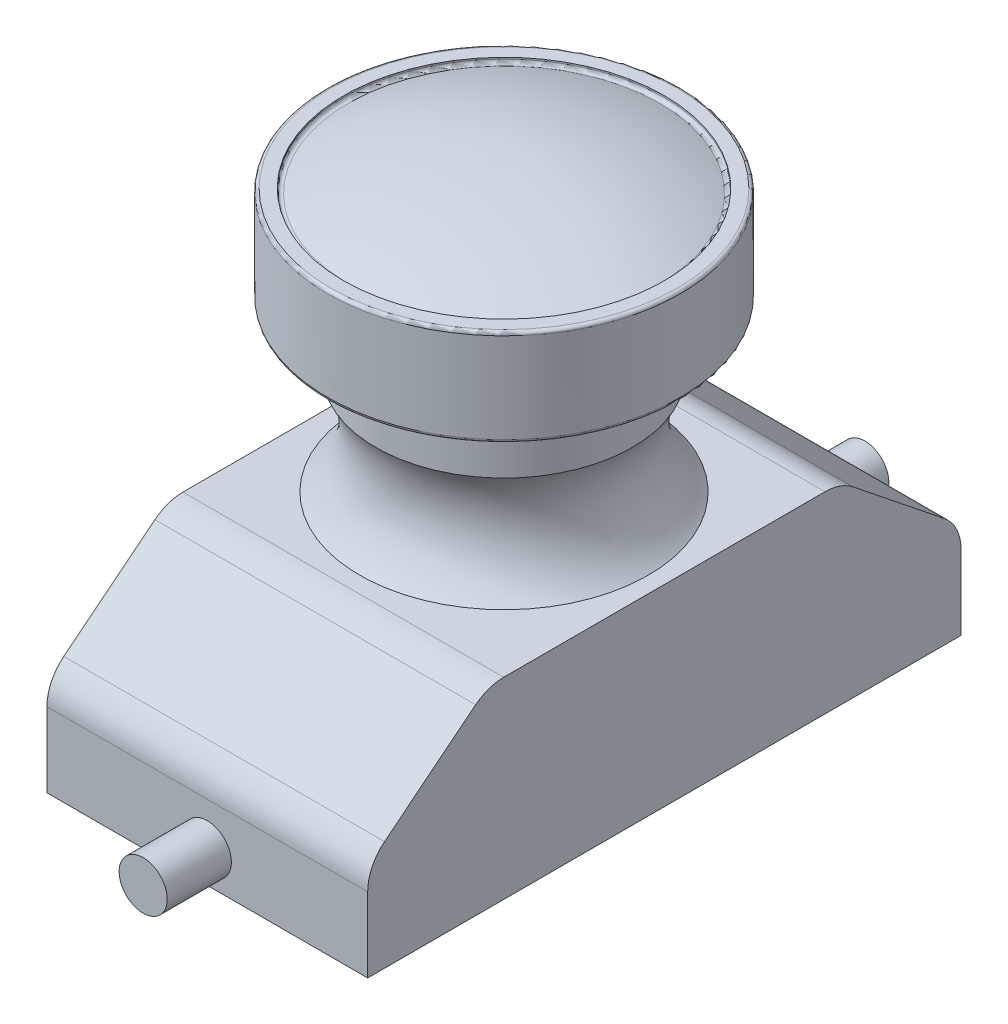
ISO-10303-21;
HEADER;
FILE_DESCRIPTION(('STEP AP214'),'2;1');
FILE_NAME('part.step','',(''),(''),'','','');
FILE_SCHEMA(('AUTOMOTIVE_DESIGN { 1 0 10303 214 1 1 1 1 }'));
ENDSEC;
DATA;
#1=APPLICATION_CONTEXT('core data for automotive mechanical design processes');
#2=APPLICATION_PROTOCOL_DEFINITION('international standard','automotive_design',2000,#1);
#3=PRODUCT_CONTEXT('',#1,'mechanical');
#4=PRODUCT('Part','Part','',(#3));
#5=PRODUCT_RELATED_PRODUCT_CATEGORY('part','',(#4));
#6=PRODUCT_DEFINITION_FORMATION('','',#4);
#7=PRODUCT_DEFINITION_CONTEXT('part definition',#1,'design');
#8=PRODUCT_DEFINITION('design','',#6,#7);
#9=PRODUCT_DEFINITION_SHAPE('','',#8);
#10=(LENGTH_UNIT() NAMED_UNIT(*) SI_UNIT(.MILLI.,.METRE.));
#11=(NAMED_UNIT(*) PLANE_ANGLE_UNIT() SI_UNIT($,.RADIAN.));
#12=(NAMED_UNIT(*) SI_UNIT($,.STERADIAN.) SOLID_ANGLE_UNIT());
#13=UNCERTAINTY_MEASURE_WITH_UNIT(LENGTH_MEASURE(1.E-05),#10,'distance_accuracy_value','');
#14=(GEOMETRIC_REPRESENTATION_CONTEXT(3) GLOBAL_UNCERTAINTY_ASSIGNED_CONTEXT((#13)) GLOBAL_UNIT_ASSIGNED_CONTEXT((#10,
#11,#12)) REPRESENTATION_CONTEXT('',''));
#15=CARTESIAN_POINT('',(0.,0.,0.));
#16=DIRECTION('',(0.,0.,1.));
#17=DIRECTION('',(1.,0.,0.));
#18=AXIS2_PLACEMENT_3D('',#15,#16,#17);
#19=CARTESIAN_POINT('',(5.,0.,9.25));
#20=DIRECTION('',(0.,0.,-1.));
#21=DIRECTION('',(-1.,0.,0.));
#22=AXIS2_PLACEMENT_3D('',#19,#20,#21);
#23=PLANE('',#22);
#24=CARTESIAN_POINT('',(0.,1.,9.25));
#25=DIRECTION('',(0.,0.,-1.));
#26=DIRECTION('',(-1.,0.,0.));
#27=AXIS2_PLACEMENT_3D('',#24,#25,#26);
#28=CIRCLE('',#27,0.75);
#29=CARTESIAN_POINT('',(-0.75,1.,9.25));
#30=VERTEX_POINT('',#29);
#31=EDGE_CURVE('E368',#30,#30,#28,.T.);
#32=ORIENTED_EDGE('',*,*,#31,.T.);
#33=EDGE_LOOP('',(#32));
#34=FACE_BOUND('',#33,.T.);
#35=DIRECTION('',(0.,-1.,0.));
#36=VECTOR('',#35,1.);
#37=CARTESIAN_POINT('',(5.,0.,9.25));
#38=LINE('',#37,#36);
#39=CARTESIAN_POINT('',(5.,2.3271252135188,9.25));
#40=VERTEX_POINT('',#39);
#41=CARTESIAN_POINT('',(5.,0.,9.25));
#42=VERTEX_POINT('',#41);
#43=EDGE_CURVE('E267',#40,#42,#38,.T.);
#44=ORIENTED_EDGE('',*,*,#43,.F.);
#45=DIRECTION('',(-1.,0.,0.));
#46=VECTOR('',#45,1.);
#47=CARTESIAN_POINT('',(5.,2.3271252135188,9.25));
#48=LINE('',#47,#46);
#49=CARTESIAN_POINT('',(-5.,2.3271252135188,9.25));
#50=VERTEX_POINT('',#49);
#51=EDGE_CURVE('E299',#40,#50,#48,.T.);
#52=ORIENTED_EDGE('',*,*,#51,.T.);
#53=DIRECTION('',(0.,-1.,0.));
#54=VECTOR('',#53,1.);
#55=CARTESIAN_POINT('',(-5.,0.,9.25));
#56=LINE('',#55,#54);
#57=CARTESIAN_POINT('',(-5.,0.,9.25));
#58=VERTEX_POINT('',#57);
#59=EDGE_CURVE('E332',#50,#58,#56,.T.);
#60=ORIENTED_EDGE('',*,*,#59,.T.);
#61=DIRECTION('',(-1.,0.,0.));
#62=VECTOR('',#61,1.);
#63=CARTESIAN_POINT('',(5.,0.,9.25));
#64=LINE('',#63,#62);
#65=EDGE_CURVE('E271',#42,#58,#64,.T.);
#66=ORIENTED_EDGE('',*,*,#65,.F.);
#67=EDGE_LOOP('',(#44,#52,#60,#66));
#68=FACE_BOUND('',#67,.T.);
#69=ADVANCED_FACE('F55',(#34,#68),#23,.F.);
#70=CARTESIAN_POINT('',(5.,0.,9.25));
#71=DIRECTION('',(0.,1.,0.));
#72=DIRECTION('',(0.,0.,1.));
#73=AXIS2_PLACEMENT_3D('',#70,#71,#72);
#74=PLANE('',#73);
#75=DIRECTION('',(0.,0.,-1.));
#76=VECTOR('',#75,1.);
#77=CARTESIAN_POINT('',(-5.,0.,9.25));
#78=LINE('',#77,#76);
#79=CARTESIAN_POINT('',(-5.,0.,-9.25));
#80=VERTEX_POINT('',#79);
#81=EDGE_CURVE('E260',#58,#80,#78,.T.);
#82=ORIENTED_EDGE('',*,*,#81,.T.);
#83=DIRECTION('',(-1.,0.,0.));
#84=VECTOR('',#83,1.);
#85=CARTESIAN_POINT('',(5.,0.,-9.25));
#86=LINE('',#85,#84);
#87=CARTESIAN_POINT('',(5.,0.,-9.25));
#88=VERTEX_POINT('',#87);
#89=EDGE_CURVE('E268',#88,#80,#86,.T.);
#90=ORIENTED_EDGE('',*,*,#89,.F.);
#91=DIRECTION('',(0.,0.,-1.));
#92=VECTOR('',#91,1.);
#93=CARTESIAN_POINT('',(5.,0.,9.25));
#94=LINE('',#93,#92);
#95=EDGE_CURVE('E235',#42,#88,#94,.T.);
#96=ORIENTED_EDGE('',*,*,#95,.F.);
#97=ORIENTED_EDGE('',*,*,#65,.T.);
#98=EDGE_LOOP('',(#82,#90,#96,#97));
#99=FACE_BOUND('',#98,.T.);
#100=ADVANCED_FACE('F155',(#99),#74,.F.);
#101=CARTESIAN_POINT('',(5.,3.,-9.25));
#102=DIRECTION('',(0.,0.,1.));
#103=DIRECTION('',(1.,0.,0.));
#104=AXIS2_PLACEMENT_3D('',#101,#102,#103);
#105=PLANE('',#104);
#106=CARTESIAN_POINT('',(0.,1.,-9.25));
#107=DIRECTION('',(0.,0.,1.));
#108=DIRECTION('',(1.,0.,0.));
#109=AXIS2_PLACEMENT_3D('',#106,#107,#108);
#110=CIRCLE('',#109,0.75);
#111=CARTESIAN_POINT('',(0.75,1.,-9.25));
#112=VERTEX_POINT('',#111);
#113=EDGE_CURVE('E11',#112,#112,#110,.F.);
#114=ORIENTED_EDGE('',*,*,#113,.F.);
#115=EDGE_LOOP('',(#114));
#116=FACE_BOUND('',#115,.T.);
#117=DIRECTION('',(0.,1.,0.));
#118=VECTOR('',#117,1.);
#119=CARTESIAN_POINT('',(-5.,3.,-9.25));
#120=LINE('',#119,#118);
#121=CARTESIAN_POINT('',(-5.,2.3271252135188,-9.25));
#122=VERTEX_POINT('',#121);
#123=EDGE_CURVE('E229',#80,#122,#120,.T.);
#124=ORIENTED_EDGE('',*,*,#123,.T.);
#125=DIRECTION('',(-1.,0.,0.));
#126=VECTOR('',#125,1.);
#127=CARTESIAN_POINT('',(5.,2.3271252135188,-9.25));
#128=LINE('',#127,#126);
#129=CARTESIAN_POINT('',(5.,2.3271252135188,-9.25));
#130=VERTEX_POINT('',#129);
#131=EDGE_CURVE('E64',#122,#130,#128,.F.);
#132=ORIENTED_EDGE('',*,*,#131,.T.);
#133=DIRECTION('',(0.,1.,0.));
#134=VECTOR('',#133,1.);
#135=CARTESIAN_POINT('',(5.,3.,-9.25));
#136=LINE('',#135,#134);
#137=EDGE_CURVE('E227',#88,#130,#136,.T.);
#138=ORIENTED_EDGE('',*,*,#137,.F.);
#139=ORIENTED_EDGE('',*,*,#89,.T.);
#140=EDGE_LOOP('',(#124,#132,#138,#139));
#141=FACE_BOUND('',#140,.T.);
#142=ADVANCED_FACE('F161',(#116,#141),#105,.F.);
#143=CARTESIAN_POINT('',(5.,6.,-5.5));
#144=DIRECTION('',(0.,-0.78086880944303,0.624695047554424));
#145=DIRECTION('',(0.,-0.624695047554424,-0.78086880944303));
#146=AXIS2_PLACEMENT_3D('',#143,#144,#145);
#147=PLANE('',#146);
#148=DIRECTION('',(0.,0.624695047554424,0.78086880944303));
#149=VECTOR('',#148,1.);
#150=CARTESIAN_POINT('',(-5.,6.,-5.5));
#151=LINE('',#150,#149);
#152=CARTESIAN_POINT('',(-5.,3.42034154673905,-8.72457306657619));
#153=VERTEX_POINT('',#152);
#154=CARTESIAN_POINT('',(-5.,5.69321633322024,-5.8834795834747));
#155=VERTEX_POINT('',#154);
#156=EDGE_CURVE('E246',#153,#155,#151,.T.);
#157=ORIENTED_EDGE('',*,*,#156,.T.);
#158=DIRECTION('',(-1.,0.,0.));
#159=VECTOR('',#158,1.);
#160=CARTESIAN_POINT('',(5.,5.69321633322024,-5.8834795834747));
#161=LINE('',#160,#159);
#162=CARTESIAN_POINT('',(5.,5.69321633322024,-5.8834795834747));
#163=VERTEX_POINT('',#162);
#164=EDGE_CURVE('E192',#155,#163,#161,.F.);
#165=ORIENTED_EDGE('',*,*,#164,.T.);
#166=DIRECTION('',(0.,0.624695047554424,0.78086880944303));
#167=VECTOR('',#166,1.);
#168=CARTESIAN_POINT('',(5.,6.,-5.5));
#169=LINE('',#168,#167);
#170=CARTESIAN_POINT('',(5.,3.42034154673905,-8.72457306657619));
#171=VERTEX_POINT('',#170);
#172=EDGE_CURVE('E238',#171,#163,#169,.T.);
#173=ORIENTED_EDGE('',*,*,#172,.F.);
#174=DIRECTION('',(-1.,0.,0.));
#175=VECTOR('',#174,1.);
#176=CARTESIAN_POINT('',(5.,3.42034154673905,-8.72457306657619));
#177=LINE('',#176,#175);
#178=EDGE_CURVE('E214',#171,#153,#177,.T.);
#179=ORIENTED_EDGE('',*,*,#178,.T.);
#180=EDGE_LOOP('',(#157,#165,#173,#179));
#181=FACE_BOUND('',#180,.T.);
#182=ADVANCED_FACE('F245',(#181),#147,.F.);
#183=CARTESIAN_POINT('',(5.,6.,5.5));
#184=DIRECTION('',(0.,-1.,0.));
#185=DIRECTION('',(0.,0.,-1.));
#186=AXIS2_PLACEMENT_3D('',#183,#184,#185);
#187=PLANE('',#186);
#188=CARTESIAN_POINT('',(0.,6.,0.));
#189=DIRECTION('',(0.,-1.,0.));
#190=DIRECTION('',(0.,0.,-1.));
#191=AXIS2_PLACEMENT_3D('',#188,#189,#190);
#192=CIRCLE('',#191,4.5);
#193=CARTESIAN_POINT('',(0.,6.,-4.5));
#194=VERTEX_POINT('',#193);
#195=EDGE_CURVE('E335',#194,#194,#192,.T.);
#196=ORIENTED_EDGE('',*,*,#195,.T.);
#197=EDGE_LOOP('',(#196));
#198=FACE_BOUND('',#197,.T.);
#199=DIRECTION('',(0.,0.,1.));
#200=VECTOR('',#199,1.);
#201=CARTESIAN_POINT('',(-5.,6.,5.5));
#202=LINE('',#201,#200);
#203=CARTESIAN_POINT('',(-5.,6.,-5.0089065168985));
#204=VERTEX_POINT('',#203);
#205=CARTESIAN_POINT('',(-5.,6.,5.0089065168985));
#206=VERTEX_POINT('',#205);
#207=EDGE_CURVE('E253',#204,#206,#202,.T.);
#208=ORIENTED_EDGE('',*,*,#207,.T.);
#209=DIRECTION('',(-1.,0.,0.));
#210=VECTOR('',#209,1.);
#211=CARTESIAN_POINT('',(5.,6.,5.0089065168985));
#212=LINE('',#211,#210);
#213=CARTESIAN_POINT('',(5.,6.,5.0089065168985));
#214=VERTEX_POINT('',#213);
#215=EDGE_CURVE('E71',#206,#214,#212,.F.);
#216=ORIENTED_EDGE('',*,*,#215,.T.);
#217=DIRECTION('',(0.,0.,1.));
#218=VECTOR('',#217,1.);
#219=CARTESIAN_POINT('',(5.,6.,5.5));
#220=LINE('',#219,#218);
#221=CARTESIAN_POINT('',(5.,6.,-5.0089065168985));
#222=VERTEX_POINT('',#221);
#223=EDGE_CURVE('E328',#222,#214,#220,.T.);
#224=ORIENTED_EDGE('',*,*,#223,.F.);
#225=DIRECTION('',(-1.,0.,0.));
#226=VECTOR('',#225,1.);
#227=CARTESIAN_POINT('',(5.,6.,-5.0089065168985));
#228=LINE('',#227,#226);
#229=EDGE_CURVE('E194',#222,#204,#228,.T.);
#230=ORIENTED_EDGE('',*,*,#229,.T.);
#231=EDGE_LOOP('',(#208,#216,#224,#230));
#232=FACE_BOUND('',#231,.T.);
#233=ADVANCED_FACE('F402',(#198,#232),#187,.F.);
#234=CARTESIAN_POINT('',(5.,3.,9.25));
#235=DIRECTION('',(0.,-0.78086880944303,-0.624695047554424));
#236=DIRECTION('',(0.,0.624695047554424,-0.78086880944303));
#237=AXIS2_PLACEMENT_3D('',#234,#235,#236);
#238=PLANE('',#237);
#239=DIRECTION('',(0.,-0.624695047554424,0.78086880944303));
#240=VECTOR('',#239,1.);
#241=CARTESIAN_POINT('',(-5.,3.,9.25));
#242=LINE('',#241,#240);
#243=CARTESIAN_POINT('',(-5.,5.69321633322024,5.8834795834747));
#244=VERTEX_POINT('',#243);
#245=CARTESIAN_POINT('',(-5.,3.42034154673905,8.72457306657619));
#246=VERTEX_POINT('',#245);
#247=EDGE_CURVE('E258',#244,#246,#242,.T.);
#248=ORIENTED_EDGE('',*,*,#247,.T.);
#249=DIRECTION('',(-1.,0.,0.));
#250=VECTOR('',#249,1.);
#251=CARTESIAN_POINT('',(5.,3.42034154673905,8.72457306657619));
#252=LINE('',#251,#250);
#253=CARTESIAN_POINT('',(5.,3.42034154673905,8.72457306657619));
#254=VERTEX_POINT('',#253);
#255=EDGE_CURVE('E204',#246,#254,#252,.F.);
#256=ORIENTED_EDGE('',*,*,#255,.T.);
#257=DIRECTION('',(0.,-0.624695047554424,0.78086880944303));
#258=VECTOR('',#257,1.);
#259=CARTESIAN_POINT('',(5.,3.,9.25));
#260=LINE('',#259,#258);
#261=CARTESIAN_POINT('',(5.,5.69321633322024,5.8834795834747));
#262=VERTEX_POINT('',#261);
#263=EDGE_CURVE('E272',#262,#254,#260,.T.);
#264=ORIENTED_EDGE('',*,*,#263,.F.);
#265=DIRECTION('',(-1.,0.,0.));
#266=VECTOR('',#265,1.);
#267=CARTESIAN_POINT('',(5.,5.69321633322024,5.8834795834747));
#268=LINE('',#267,#266);
#269=EDGE_CURVE('E313',#262,#244,#268,.T.);
#270=ORIENTED_EDGE('',*,*,#269,.T.);
#271=EDGE_LOOP('',(#248,#256,#264,#270));
#272=FACE_BOUND('',#271,.T.);
#273=ADVANCED_FACE('F321',(#272),#238,.F.);
#274=CARTESIAN_POINT('',(5.,0.,0.));
#275=DIRECTION('',(-1.,0.,0.));
#276=DIRECTION('',(0.,0.,1.));
#277=AXIS2_PLACEMENT_3D('',#274,#275,#276);
#278=PLANE('',#277);
#279=ORIENTED_EDGE('',*,*,#263,.T.);
#280=CARTESIAN_POINT('',(5.,2.3271252135188,7.85));
#281=DIRECTION('',(-1.,0.,0.));
#282=DIRECTION('',(0.,0.,1.));
#283=AXIS2_PLACEMENT_3D('',#280,#281,#282);
#284=CIRCLE('',#283,1.4);
#285=EDGE_CURVE('E202',#254,#40,#284,.F.);
#286=ORIENTED_EDGE('',*,*,#285,.T.);
#287=ORIENTED_EDGE('',*,*,#43,.T.);
#288=ORIENTED_EDGE('',*,*,#95,.T.);
#289=ORIENTED_EDGE('',*,*,#137,.T.);
#290=CARTESIAN_POINT('',(5.,2.3271252135188,-7.85));
#291=DIRECTION('',(-1.,0.,0.));
#292=DIRECTION('',(0.,0.,1.));
#293=AXIS2_PLACEMENT_3D('',#290,#291,#292);
#294=CIRCLE('',#293,1.4);
#295=EDGE_CURVE('E197',#130,#171,#294,.F.);
#296=ORIENTED_EDGE('',*,*,#295,.T.);
#297=ORIENTED_EDGE('',*,*,#172,.T.);
#298=CARTESIAN_POINT('',(5.,4.6,-5.0089065168985));
#299=DIRECTION('',(-1.,0.,0.));
#300=DIRECTION('',(0.,0.,1.));
#301=AXIS2_PLACEMENT_3D('',#298,#299,#300);
#302=CIRCLE('',#301,1.4);
#303=EDGE_CURVE('E78',#163,#222,#302,.F.);
#304=ORIENTED_EDGE('',*,*,#303,.T.);
#305=ORIENTED_EDGE('',*,*,#223,.T.);
#306=CARTESIAN_POINT('',(5.,4.6,5.0089065168985));
#307=DIRECTION('',(-1.,0.,0.));
#308=DIRECTION('',(0.,0.,1.));
#309=AXIS2_PLACEMENT_3D('',#306,#307,#308);
#310=CIRCLE('',#309,1.4);
#311=EDGE_CURVE('E196',#214,#262,#310,.F.);
#312=ORIENTED_EDGE('',*,*,#311,.T.);
#313=EDGE_LOOP('',(#279,#286,#287,#288,#289,#296,#297,#304,#305,#312));
#314=FACE_BOUND('',#313,.T.);
#315=ADVANCED_FACE('F232',(#314),#278,.F.);
#316=CARTESIAN_POINT('',(-5.,0.,0.));
#317=DIRECTION('',(-1.,0.,0.));
#318=DIRECTION('',(0.,0.,1.));
#319=AXIS2_PLACEMENT_3D('',#316,#317,#318);
#320=PLANE('',#319);
#321=ORIENTED_EDGE('',*,*,#59,.F.);
#322=CARTESIAN_POINT('',(-5.,2.3271252135188,7.85));
#323=DIRECTION('',(-1.,0.,0.));
#324=DIRECTION('',(0.,0.,1.));
#325=AXIS2_PLACEMENT_3D('',#322,#323,#324);
#326=CIRCLE('',#325,1.4);
#327=EDGE_CURVE('E310',#50,#246,#326,.T.);
#328=ORIENTED_EDGE('',*,*,#327,.T.);
#329=ORIENTED_EDGE('',*,*,#247,.F.);
#330=CARTESIAN_POINT('',(-5.,4.6,5.0089065168985));
#331=DIRECTION('',(-1.,0.,0.));
#332=DIRECTION('',(0.,0.,1.));
#333=AXIS2_PLACEMENT_3D('',#330,#331,#332);
#334=CIRCLE('',#333,1.4);
#335=EDGE_CURVE('E307',#244,#206,#334,.T.);
#336=ORIENTED_EDGE('',*,*,#335,.T.);
#337=ORIENTED_EDGE('',*,*,#207,.F.);
#338=CARTESIAN_POINT('',(-5.,4.6,-5.0089065168985));
#339=DIRECTION('',(-1.,0.,0.));
#340=DIRECTION('',(0.,0.,1.));
#341=AXIS2_PLACEMENT_3D('',#338,#339,#340);
#342=CIRCLE('',#341,1.4);
#343=EDGE_CURVE('E251',#204,#155,#342,.T.);
#344=ORIENTED_EDGE('',*,*,#343,.T.);
#345=ORIENTED_EDGE('',*,*,#156,.F.);
#346=CARTESIAN_POINT('',(-5.,2.3271252135188,-7.85));
#347=DIRECTION('',(-1.,0.,0.));
#348=DIRECTION('',(0.,0.,1.));
#349=AXIS2_PLACEMENT_3D('',#346,#347,#348);
#350=CIRCLE('',#349,1.4);
#351=EDGE_CURVE('E241',#153,#122,#350,.T.);
#352=ORIENTED_EDGE('',*,*,#351,.T.);
#353=ORIENTED_EDGE('',*,*,#123,.F.);
#354=ORIENTED_EDGE('',*,*,#81,.F.);
#355=EDGE_LOOP('',(#321,#328,#329,#336,#337,#344,#345,#352,#353,#354));
#356=FACE_BOUND('',#355,.T.);
#357=ADVANCED_FACE('F249',(#356),#320,.T.);
#358=CARTESIAN_POINT('',(0.,7.89402615915736,0.));
#359=DIRECTION('',(0.,-1.,0.));
#360=DIRECTION('',(0.,0.,-1.));
#361=AXIS2_PLACEMENT_3D('',#358,#359,#360);
#362=TOROIDAL_SURFACE('',#361,6.13176741860708,2.5);
#363=CARTESIAN_POINT('',(0.,9.20000000000001,0.));
#364=DIRECTION('',(0.,-1.,0.));
#365=DIRECTION('',(0.,0.,-1.));
#366=AXIS2_PLACEMENT_3D('',#363,#364,#365);
#367=CIRCLE('',#366,4.);
#368=CARTESIAN_POINT('',(0.,9.20000000000001,-4.));
#369=VERTEX_POINT('',#368);
#370=EDGE_CURVE('E341',#369,#369,#367,.T.);
#371=ORIENTED_EDGE('',*,*,#370,.T.);
#372=EDGE_LOOP('',(#371));
#373=FACE_BOUND('',#372,.T.);
#374=ORIENTED_EDGE('',*,*,#195,.F.);
#375=EDGE_LOOP('',(#374));
#376=FACE_BOUND('',#375,.T.);
#377=ADVANCED_FACE('F412',(#373,#376),#362,.F.);
#378=CARTESIAN_POINT('',(0.,6.,0.));
#379=DIRECTION('',(0.,-1.,0.));
#380=DIRECTION('',(0.,0.,-1.));
#381=AXIS2_PLACEMENT_3D('',#378,#379,#380);
#382=CYLINDRICAL_SURFACE('',#381,4.);
#383=CARTESIAN_POINT('',(0.,11.2,0.));
#384=DIRECTION('',(0.,-1.,0.));
#385=DIRECTION('',(0.,0.,-1.));
#386=AXIS2_PLACEMENT_3D('',#383,#384,#385);
#387=CIRCLE('',#386,4.);
#388=CARTESIAN_POINT('',(0.,11.2,-4.));
#389=VERTEX_POINT('',#388);
#390=EDGE_CURVE('E355',#389,#389,#387,.T.);
#391=ORIENTED_EDGE('',*,*,#390,.T.);
#392=EDGE_LOOP('',(#391));
#393=FACE_BOUND('',#392,.T.);
#394=ORIENTED_EDGE('',*,*,#370,.F.);
#395=EDGE_LOOP('',(#394));
#396=FACE_BOUND('',#395,.T.);
#397=ADVANCED_FACE('F417',(#393,#396),#382,.T.);
#398=CARTESIAN_POINT('',(0.,11.2,-5.5));
#399=DIRECTION('',(0.,-1.,0.));
#400=DIRECTION('',(0.,0.,-1.));
#401=AXIS2_PLACEMENT_3D('',#398,#399,#400);
#402=PLANE('',#401);
#403=CARTESIAN_POINT('',(0.,11.2,0.));
#404=DIRECTION('',(0.,-1.,0.));
#405=DIRECTION('',(0.,0.,-1.));
#406=AXIS2_PLACEMENT_3D('',#403,#404,#405);
#407=CIRCLE('',#406,5.4);
#408=CARTESIAN_POINT('',(0.,11.2,-5.4));
#409=VERTEX_POINT('',#408);
#410=EDGE_CURVE('E276',#409,#409,#407,.T.);
#411=ORIENTED_EDGE('',*,*,#410,.T.);
#412=EDGE_LOOP('',(#411));
#413=FACE_BOUND('',#412,.T.);
#414=ORIENTED_EDGE('',*,*,#390,.F.);
#415=EDGE_LOOP('',(#414));
#416=FACE_BOUND('',#415,.T.);
#417=ADVANCED_FACE('F421',(#413,#416),#402,.T.);
#418=CARTESIAN_POINT('',(0.,6.,0.));
#419=DIRECTION('',(0.,-1.,0.));
#420=DIRECTION('',(0.,0.,-1.));
#421=AXIS2_PLACEMENT_3D('',#418,#419,#420);
#422=CYLINDRICAL_SURFACE('',#421,5.5);
#423=CARTESIAN_POINT('',(0.,11.3,0.));
#424=DIRECTION('',(0.,-1.,0.));
#425=DIRECTION('',(0.,0.,-1.));
#426=AXIS2_PLACEMENT_3D('',#423,#424,#425);
#427=CIRCLE('',#426,5.5);
#428=CARTESIAN_POINT('',(0.,11.3,-5.5));
#429=VERTEX_POINT('',#428);
#430=EDGE_CURVE('E284',#429,#429,#427,.F.);
#431=ORIENTED_EDGE('',*,*,#430,.T.);
#432=EDGE_LOOP('',(#431));
#433=FACE_BOUND('',#432,.T.);
#434=CARTESIAN_POINT('',(0.,14.1,0.));
#435=DIRECTION('',(0.,1.,0.));
#436=DIRECTION('',(0.,0.,1.));
#437=AXIS2_PLACEMENT_3D('',#434,#435,#436);
#438=CIRCLE('',#437,5.5);
#439=CARTESIAN_POINT('',(0.,14.1,5.5));
#440=VERTEX_POINT('',#439);
#441=EDGE_CURVE('E280',#440,#440,#438,.F.);
#442=ORIENTED_EDGE('',*,*,#441,.T.);
#443=EDGE_LOOP('',(#442));
#444=FACE_BOUND('',#443,.T.);
#445=ADVANCED_FACE('F425',(#433,#444),#422,.T.);
#446=CARTESIAN_POINT('',(0.,14.2,-5.));
#447=DIRECTION('',(0.,1.,0.));
#448=DIRECTION('',(0.,0.,1.));
#449=AXIS2_PLACEMENT_3D('',#446,#447,#448);
#450=PLANE('',#449);
#451=CARTESIAN_POINT('',(0.,14.2,0.));
#452=DIRECTION('',(0.,1.,0.));
#453=DIRECTION('',(0.,0.,1.));
#454=AXIS2_PLACEMENT_3D('',#451,#452,#453);
#455=CIRCLE('',#454,5.4);
#456=CARTESIAN_POINT('',(0.,14.2,5.4));
#457=VERTEX_POINT('',#456);
#458=EDGE_CURVE('E288',#457,#457,#455,.T.);
#459=ORIENTED_EDGE('',*,*,#458,.T.);
#460=EDGE_LOOP('',(#459));
#461=FACE_BOUND('',#460,.T.);
#462=CARTESIAN_POINT('',(0.,14.2,0.));
#463=DIRECTION('',(0.,-1.,0.));
#464=DIRECTION('',(0.,0.,-1.));
#465=AXIS2_PLACEMENT_3D('',#462,#463,#464);
#466=CIRCLE('',#465,5.);
#467=CARTESIAN_POINT('',(0.,14.2,-5.));
#468=VERTEX_POINT('',#467);
#469=EDGE_CURVE('E359',#468,#468,#466,.T.);
#470=ORIENTED_EDGE('',*,*,#469,.T.);
#471=EDGE_LOOP('',(#470));
#472=FACE_BOUND('',#471,.T.);
#473=ADVANCED_FACE('F149',(#461,#472),#450,.T.);
#474=CARTESIAN_POINT('',(0.,6.,0.));
#475=DIRECTION('',(0.,-1.,0.));
#476=DIRECTION('',(0.,0.,-1.));
#477=AXIS2_PLACEMENT_3D('',#474,#475,#476);
#478=CYLINDRICAL_SURFACE('',#477,5.);
#479=CARTESIAN_POINT('',(0.,14.151701238125,0.));
#480=DIRECTION('',(0.,-1.,0.));
#481=DIRECTION('',(0.,0.,-1.));
#482=AXIS2_PLACEMENT_3D('',#479,#480,#481);
#483=CIRCLE('',#482,5.);
#484=CARTESIAN_POINT('',(0.,14.151701238125,-5.));
#485=VERTEX_POINT('',#484);
#486=EDGE_CURVE('E292',#485,#485,#483,.T.);
#487=ORIENTED_EDGE('',*,*,#486,.T.);
#488=EDGE_LOOP('',(#487));
#489=FACE_BOUND('',#488,.T.);
#490=ORIENTED_EDGE('',*,*,#469,.F.);
#491=EDGE_LOOP('',(#490));
#492=FACE_BOUND('',#491,.T.);
#493=ADVANCED_FACE('F139',(#489,#492),#478,.F.);
#494=CARTESIAN_POINT('',(0.,3.00167236240251,-0.200334472480498));
#495=DIRECTION('',(-1.,0.,0.));
#496=DIRECTION('',(0.,0.,-1.));
#497=AXIS2_PLACEMENT_3D('',#494,#495,#496);
#498=CIRCLE('',#497,12.);
#499=TRIMMED_CURVE('',#498,(PARAMETER_VALUE(-1.58749164174817)),
(PARAMETER_VALUE(1.58749164174817)),.T.,.PARAMETER.);
#500=CARTESIAN_POINT('',(0.,3.00167236240251,0.));
#501=DIRECTION('',(0.,-1.,0.));
#502=AXIS1_PLACEMENT('',#500,#501);
#503=SURFACE_OF_REVOLUTION('',#499,#502);
#504=CARTESIAN_POINT('',(0.,14.0595522391521,0.));
#505=DIRECTION('',(0.,-1.,0.));
#506=DIRECTION('',(0.,0.,-1.));
#507=AXIS2_PLACEMENT_3D('',#504,#505,#506);
#508=CIRCLE('',#507,4.86115978902877);
#509=CARTESIAN_POINT('',(0.,14.0595522391521,-4.86115978902877));
#510=VERTEX_POINT('',#509);
#511=EDGE_CURVE('E296',#510,#510,#508,.F.);
#512=ORIENTED_EDGE('',*,*,#511,.T.);
#513=EDGE_LOOP('',(#512));
#514=FACE_BOUND('',#513,.T.);
#515=CARTESIAN_POINT('',(0.,15.,0.));
#516=VERTEX_POINT('',#515);
#517=VERTEX_LOOP('',#516);
#518=FACE_BOUND('',#517,.T.);
#519=ADVANCED_FACE('F136',(#514,#518),#503,.T.);
#520=CARTESIAN_POINT('',(0.,11.3,0.));
#521=DIRECTION('',(0.,-1.,0.));
#522=DIRECTION('',(0.,0.,-1.));
#523=AXIS2_PLACEMENT_3D('',#520,#521,#522);
#524=TOROIDAL_SURFACE('',#523,5.4,0.1);
#525=ORIENTED_EDGE('',*,*,#430,.F.);
#526=EDGE_LOOP('',(#525));
#527=FACE_BOUND('',#526,.T.);
#528=ORIENTED_EDGE('',*,*,#410,.F.);
#529=EDGE_LOOP('',(#528));
#530=FACE_BOUND('',#529,.T.);
#531=ADVANCED_FACE('F138',(#527,#530),#524,.T.);
#532=CARTESIAN_POINT('',(0.,14.1,0.));
#533=DIRECTION('',(0.,1.,0.));
#534=DIRECTION('',(0.,0.,1.));
#535=AXIS2_PLACEMENT_3D('',#532,#533,#534);
#536=TOROIDAL_SURFACE('',#535,5.4,0.1);
#537=ORIENTED_EDGE('',*,*,#458,.F.);
#538=EDGE_LOOP('',(#537));
#539=FACE_BOUND('',#538,.T.);
#540=ORIENTED_EDGE('',*,*,#441,.F.);
#541=EDGE_LOOP('',(#540));
#542=FACE_BOUND('',#541,.T.);
#543=ADVANCED_FACE('F145',(#539,#542),#536,.T.);
#544=CARTESIAN_POINT('',(0.,14.151701238125,0.));
#545=DIRECTION('',(0.,-1.,0.));
#546=DIRECTION('',(0.,0.,-1.));
#547=AXIS2_PLACEMENT_3D('',#544,#545,#546);
#548=TOROIDAL_SURFACE('',#547,4.9,0.1);
#549=ORIENTED_EDGE('',*,*,#511,.F.);
#550=EDGE_LOOP('',(#549));
#551=FACE_BOUND('',#550,.T.);
#552=ORIENTED_EDGE('',*,*,#486,.F.);
#553=EDGE_LOOP('',(#552));
#554=FACE_BOUND('',#553,.T.);
#555=ADVANCED_FACE('F170',(#551,#554),#548,.F.);
#556=CARTESIAN_POINT('',(5.,2.3271252135188,7.85));
#557=DIRECTION('',(-1.,0.,0.));
#558=DIRECTION('',(0.,0.,1.));
#559=AXIS2_PLACEMENT_3D('',#556,#557,#558);
#560=CYLINDRICAL_SURFACE('',#559,1.4);
#561=ORIENTED_EDGE('',*,*,#285,.F.);
#562=ORIENTED_EDGE('',*,*,#255,.F.);
#563=ORIENTED_EDGE('',*,*,#327,.F.);
#564=ORIENTED_EDGE('',*,*,#51,.F.);
#565=EDGE_LOOP('',(#561,#562,#563,#564));
#566=FACE_BOUND('',#565,.T.);
#567=ADVANCED_FACE('F174',(#566),#560,.T.);
#568=CARTESIAN_POINT('',(5.,4.6,5.0089065168985));
#569=DIRECTION('',(-1.,0.,0.));
#570=DIRECTION('',(0.,0.,1.));
#571=AXIS2_PLACEMENT_3D('',#568,#569,#570);
#572=CYLINDRICAL_SURFACE('',#571,1.4);
#573=ORIENTED_EDGE('',*,*,#311,.F.);
#574=ORIENTED_EDGE('',*,*,#215,.F.);
#575=ORIENTED_EDGE('',*,*,#335,.F.);
#576=ORIENTED_EDGE('',*,*,#269,.F.);
#577=EDGE_LOOP('',(#573,#574,#575,#576));
#578=FACE_BOUND('',#577,.T.);
#579=ADVANCED_FACE('F178',(#578),#572,.T.);
#580=CARTESIAN_POINT('',(5.,4.6,-5.0089065168985));
#581=DIRECTION('',(-1.,0.,0.));
#582=DIRECTION('',(0.,0.,1.));
#583=AXIS2_PLACEMENT_3D('',#580,#581,#582);
#584=CYLINDRICAL_SURFACE('',#583,1.4);
#585=ORIENTED_EDGE('',*,*,#303,.F.);
#586=ORIENTED_EDGE('',*,*,#164,.F.);
#587=ORIENTED_EDGE('',*,*,#343,.F.);
#588=ORIENTED_EDGE('',*,*,#229,.F.);
#589=EDGE_LOOP('',(#585,#586,#587,#588));
#590=FACE_BOUND('',#589,.T.);
#591=ADVANCED_FACE('F181',(#590),#584,.T.);
#592=CARTESIAN_POINT('',(5.,2.3271252135188,-7.85));
#593=DIRECTION('',(-1.,0.,0.));
#594=DIRECTION('',(0.,0.,1.));
#595=AXIS2_PLACEMENT_3D('',#592,#593,#594);
#596=CYLINDRICAL_SURFACE('',#595,1.4);
#597=ORIENTED_EDGE('',*,*,#295,.F.);
#598=ORIENTED_EDGE('',*,*,#131,.F.);
#599=ORIENTED_EDGE('',*,*,#351,.F.);
#600=ORIENTED_EDGE('',*,*,#178,.F.);
#601=EDGE_LOOP('',(#597,#598,#599,#600));
#602=FACE_BOUND('',#601,.T.);
#603=ADVANCED_FACE('F57',(#602),#596,.T.);
#604=CARTESIAN_POINT('',(0.,1.,-11.25));
#605=DIRECTION('',(0.,0.,1.));
#606=DIRECTION('',(1.,0.,0.));
#607=AXIS2_PLACEMENT_3D('',#604,#605,#606);
#608=CYLINDRICAL_SURFACE('',#607,0.75);
#609=CARTESIAN_POINT('',(0.,1.,-11.25));
#610=DIRECTION('',(0.,0.,-1.));
#611=DIRECTION('',(-1.,0.,0.));
#612=AXIS2_PLACEMENT_3D('',#609,#610,#611);
#613=CIRCLE('',#612,0.75);
#614=CARTESIAN_POINT('',(-0.75,1.,-11.25));
#615=VERTEX_POINT('',#614);
#616=EDGE_CURVE('E363',#615,#615,#613,.T.);
#617=ORIENTED_EDGE('',*,*,#616,.F.);
#618=EDGE_LOOP('',(#617));
#619=FACE_BOUND('',#618,.T.);
#620=ORIENTED_EDGE('',*,*,#113,.T.);
#621=EDGE_LOOP('',(#620));
#622=FACE_BOUND('',#621,.T.);
#623=ADVANCED_FACE('F188',(#619,#622),#608,.T.);
#624=CARTESIAN_POINT('',(0.,1.,-11.25));
#625=DIRECTION('',(0.,0.,-1.));
#626=DIRECTION('',(-1.,0.,0.));
#627=AXIS2_PLACEMENT_3D('',#624,#625,#626);
#628=PLANE('',#627);
#629=ORIENTED_EDGE('',*,*,#616,.T.);
#630=EDGE_LOOP('',(#629));
#631=FACE_BOUND('',#630,.T.);
#632=ADVANCED_FACE('F385',(#631),#628,.T.);
#633=CARTESIAN_POINT('',(0.,1.,11.25));
#634=DIRECTION('',(0.,0.,-1.));
#635=DIRECTION('',(-1.,0.,0.));
#636=AXIS2_PLACEMENT_3D('',#633,#634,#635);
#637=CYLINDRICAL_SURFACE('',#636,0.75);
#638=CARTESIAN_POINT('',(0.,1.,11.25));
#639=DIRECTION('',(0.,0.,-1.));
#640=DIRECTION('',(-1.,0.,0.));
#641=AXIS2_PLACEMENT_3D('',#638,#639,#640);
#642=CIRCLE('',#641,0.75);
#643=CARTESIAN_POINT('',(-0.75,1.,11.25));
#644=VERTEX_POINT('',#643);
#645=EDGE_CURVE('E367',#644,#644,#642,.T.);
#646=ORIENTED_EDGE('',*,*,#645,.T.);
#647=EDGE_LOOP('',(#646));
#648=FACE_BOUND('',#647,.T.);
#649=ORIENTED_EDGE('',*,*,#31,.F.);
#650=EDGE_LOOP('',(#649));
#651=FACE_BOUND('',#650,.T.);
#652=ADVANCED_FACE('F376',(#648,#651),#637,.T.);
#653=CARTESIAN_POINT('',(0.,1.,11.25));
#654=DIRECTION('',(0.,0.,1.));
#655=DIRECTION('',(-1.,0.,0.));
#656=AXIS2_PLACEMENT_3D('',#653,#654,#655);
#657=PLANE('',#656);
#658=ORIENTED_EDGE('',*,*,#645,.F.);
#659=EDGE_LOOP('',(#658));
#660=FACE_BOUND('',#659,.T.);
#661=ADVANCED_FACE('F379',(#660),#657,.T.);
#662=CLOSED_SHELL('',(#69,#100,#142,#182,#233,#273,#315,#357,#377,#397,#417,#445,#473,#493,#519,
#531,#543,#555,#567,#579,#591,#603,#623,#632,#652,#661));
#663=MANIFOLD_SOLID_BREP('B2',#662);
#664=ADVANCED_BREP_SHAPE_REPRESENTATION('',(#18,#663),#14);
#665=SHAPE_DEFINITION_REPRESENTATION(#9,#664);
ENDSEC;
END-ISO-10303-21;
